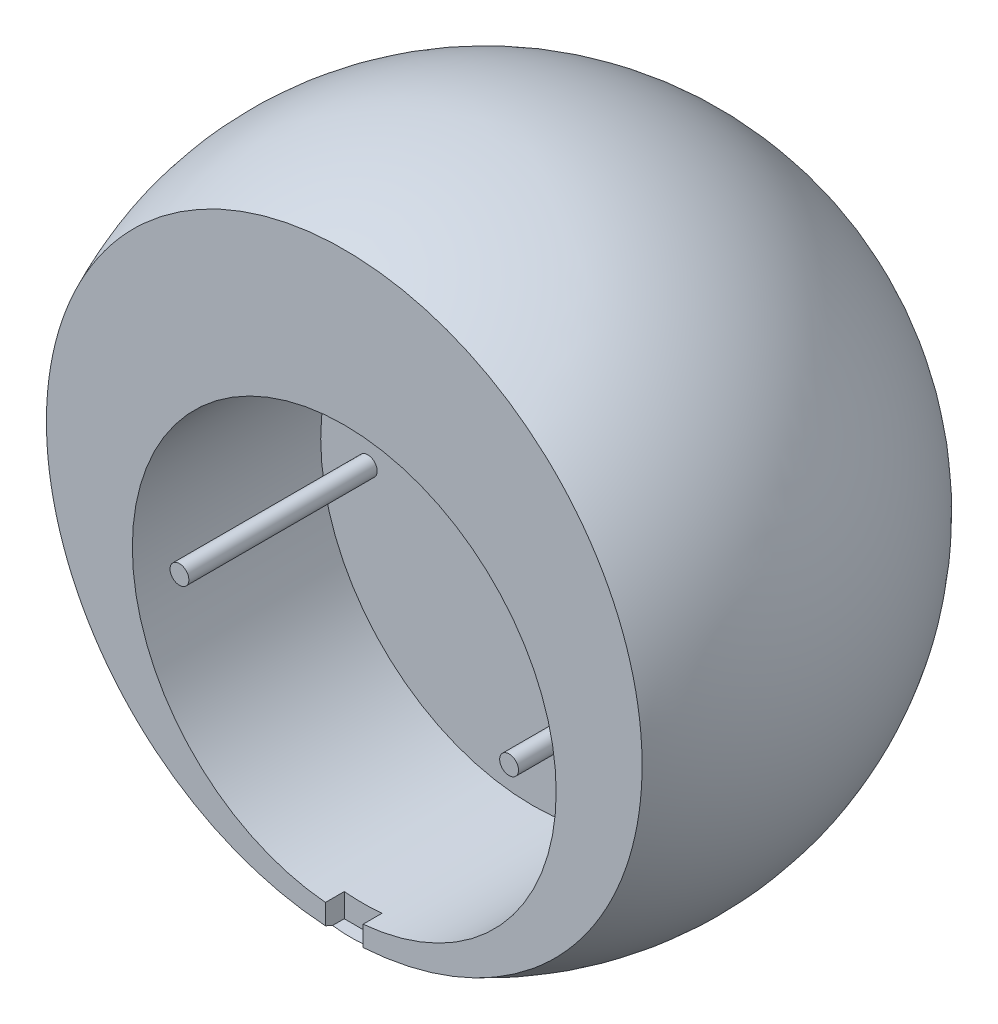
ISO-10303-21;
HEADER;
FILE_DESCRIPTION(('STEP AP214'),'2;1');
FILE_NAME('part.step','',(''),(''),'','','');
FILE_SCHEMA(('AUTOMOTIVE_DESIGN { 1 0 10303 214 1 1 1 1 }'));
ENDSEC;
DATA;
#1=APPLICATION_CONTEXT('core data for automotive mechanical design processes');
#2=APPLICATION_PROTOCOL_DEFINITION('international standard','automotive_design',2000,#1);
#3=PRODUCT_CONTEXT('',#1,'mechanical');
#4=PRODUCT('Part','Part','',(#3));
#5=PRODUCT_RELATED_PRODUCT_CATEGORY('part','',(#4));
#6=PRODUCT_DEFINITION_FORMATION('','',#4);
#7=PRODUCT_DEFINITION_CONTEXT('part definition',#1,'design');
#8=PRODUCT_DEFINITION('design','',#6,#7);
#9=PRODUCT_DEFINITION_SHAPE('','',#8);
#10=(LENGTH_UNIT() NAMED_UNIT(*) SI_UNIT(.MILLI.,.METRE.));
#11=(NAMED_UNIT(*) PLANE_ANGLE_UNIT() SI_UNIT($,.RADIAN.));
#12=(NAMED_UNIT(*) SI_UNIT($,.STERADIAN.) SOLID_ANGLE_UNIT());
#13=UNCERTAINTY_MEASURE_WITH_UNIT(LENGTH_MEASURE(1.E-05),#10,'distance_accuracy_value','');
#14=(GEOMETRIC_REPRESENTATION_CONTEXT(3) GLOBAL_UNCERTAINTY_ASSIGNED_CONTEXT((#13)) GLOBAL_UNIT_ASSIGNED_CONTEXT((#10,
#11,#12)) REPRESENTATION_CONTEXT('',''));
#15=CARTESIAN_POINT('',(0.,0.,0.));
#16=DIRECTION('',(0.,0.,1.));
#17=DIRECTION('',(1.,0.,0.));
#18=AXIS2_PLACEMENT_3D('',#15,#16,#17);
#19=CARTESIAN_POINT('',(35.,-7.,-5.));
#20=DIRECTION('',(0.,0.,1.));
#21=DIRECTION('',(1.,0.,0.));
#22=AXIS2_PLACEMENT_3D('',#19,#20,#21);
#23=PLANE('',#22);
#24=CARTESIAN_POINT('',(35.,-7.,-5.));
#25=DIRECTION('',(0.,0.,1.));
#26=DIRECTION('',(1.,0.,0.));
#27=AXIS2_PLACEMENT_3D('',#24,#25,#26);
#28=CIRCLE('',#27,22.5);
#29=CARTESIAN_POINT('',(57.5,-7.,-5.));
#30=VERTEX_POINT('',#29);
#31=EDGE_CURVE('E125',#30,#30,#28,.T.);
#32=ORIENTED_EDGE('',*,*,#31,.T.);
#33=EDGE_LOOP('',(#32));
#34=FACE_BOUND('',#33,.T.);
#35=CARTESIAN_POINT('',(17.5,-7.,-5.));
#36=DIRECTION('',(0.,0.,1.));
#37=DIRECTION('',(1.,0.,0.));
#38=AXIS2_PLACEMENT_3D('',#35,#36,#37);
#39=CIRCLE('',#38,0.999999999999998);
#40=CARTESIAN_POINT('',(18.5,-7.,-5.));
#41=VERTEX_POINT('',#40);
#42=EDGE_CURVE('E122',#41,#41,#39,.T.);
#43=ORIENTED_EDGE('',*,*,#42,.F.);
#44=EDGE_LOOP('',(#43));
#45=FACE_BOUND('',#44,.T.);
#46=CARTESIAN_POINT('',(52.5,-7.,-5.));
#47=DIRECTION('',(0.,0.,1.));
#48=DIRECTION('',(1.,0.,0.));
#49=AXIS2_PLACEMENT_3D('',#46,#47,#48);
#50=CIRCLE('',#49,0.999999999999998);
#51=CARTESIAN_POINT('',(53.5,-7.,-5.));
#52=VERTEX_POINT('',#51);
#53=EDGE_CURVE('E119',#52,#52,#50,.T.);
#54=ORIENTED_EDGE('',*,*,#53,.F.);
#55=EDGE_LOOP('',(#54));
#56=FACE_BOUND('',#55,.T.);
#57=ADVANCED_FACE('F35',(#34,#45,#56),#23,.T.);
#58=CARTESIAN_POINT('',(35.,-7.,15.));
#59=DIRECTION('',(0.,0.,-1.));
#60=DIRECTION('',(-1.,0.,0.));
#61=AXIS2_PLACEMENT_3D('',#58,#59,#60);
#62=CYLINDRICAL_SURFACE('',#61,22.5);
#63=DIRECTION('',(0.,0.,1.));
#64=VECTOR('',#63,1.);
#65=CARTESIAN_POINT('',(33.,-29.410934831015,13.));
#66=LINE('',#65,#64);
#67=CARTESIAN_POINT('',(33.,-29.410934831015,13.));
#68=VERTEX_POINT('',#67);
#69=CARTESIAN_POINT('',(33.,-29.410934831015,15.));
#70=VERTEX_POINT('',#69);
#71=EDGE_CURVE('E103',#68,#70,#66,.T.);
#72=ORIENTED_EDGE('',*,*,#71,.F.);
#73=CARTESIAN_POINT('',(35.,-7.,13.));
#74=DIRECTION('',(0.,0.,-1.));
#75=DIRECTION('',(-1.,0.,0.));
#76=AXIS2_PLACEMENT_3D('',#73,#74,#75);
#77=CIRCLE('',#76,22.5);
#78=CARTESIAN_POINT('',(37.,-29.410934831015,13.));
#79=VERTEX_POINT('',#78);
#80=EDGE_CURVE('E11',#79,#68,#77,.T.);
#81=ORIENTED_EDGE('',*,*,#80,.F.);
#82=DIRECTION('',(0.,0.,1.));
#83=VECTOR('',#82,1.);
#84=CARTESIAN_POINT('',(37.,-29.410934831015,13.));
#85=LINE('',#84,#83);
#86=CARTESIAN_POINT('',(37.,-29.410934831015,15.));
#87=VERTEX_POINT('',#86);
#88=EDGE_CURVE('E106',#79,#87,#85,.T.);
#89=ORIENTED_EDGE('',*,*,#88,.T.);
#90=CARTESIAN_POINT('',(35.,-7.,15.));
#91=DIRECTION('',(0.,0.,1.));
#92=DIRECTION('',(1.,0.,0.));
#93=AXIS2_PLACEMENT_3D('',#90,#91,#92);
#94=CIRCLE('',#93,22.5);
#95=EDGE_CURVE('E116',#87,#70,#94,.T.);
#96=ORIENTED_EDGE('',*,*,#95,.T.);
#97=EDGE_LOOP('',(#72,#81,#89,#96));
#98=FACE_BOUND('',#97,.T.);
#99=ORIENTED_EDGE('',*,*,#31,.F.);
#100=EDGE_LOOP('',(#99));
#101=FACE_BOUND('',#100,.T.);
#102=ADVANCED_FACE('F143',(#98,#101),#62,.F.);
#103=CARTESIAN_POINT('',(17.5,-7.,15.));
#104=DIRECTION('',(0.,0.,-1.));
#105=DIRECTION('',(-1.,0.,0.));
#106=AXIS2_PLACEMENT_3D('',#103,#104,#105);
#107=CYLINDRICAL_SURFACE('',#106,0.999999999999998);
#108=CARTESIAN_POINT('',(17.5,-7.,15.));
#109=DIRECTION('',(0.,0.,1.));
#110=DIRECTION('',(1.,0.,0.));
#111=AXIS2_PLACEMENT_3D('',#108,#109,#110);
#112=CIRCLE('',#111,0.999999999999998);
#113=CARTESIAN_POINT('',(18.5,-7.,15.));
#114=VERTEX_POINT('',#113);
#115=EDGE_CURVE('E113',#114,#114,#112,.T.);
#116=ORIENTED_EDGE('',*,*,#115,.F.);
#117=EDGE_LOOP('',(#116));
#118=FACE_BOUND('',#117,.T.);
#119=ORIENTED_EDGE('',*,*,#42,.T.);
#120=EDGE_LOOP('',(#119));
#121=FACE_BOUND('',#120,.T.);
#122=ADVANCED_FACE('F146',(#118,#121),#107,.T.);
#123=CARTESIAN_POINT('',(52.5,-7.,15.));
#124=DIRECTION('',(0.,0.,-1.));
#125=DIRECTION('',(-1.,0.,0.));
#126=AXIS2_PLACEMENT_3D('',#123,#124,#125);
#127=CYLINDRICAL_SURFACE('',#126,0.999999999999998);
#128=CARTESIAN_POINT('',(52.5,-7.,15.));
#129=DIRECTION('',(0.,0.,1.));
#130=DIRECTION('',(1.,0.,0.));
#131=AXIS2_PLACEMENT_3D('',#128,#129,#130);
#132=CIRCLE('',#131,0.999999999999998);
#133=CARTESIAN_POINT('',(53.5,-7.,15.));
#134=VERTEX_POINT('',#133);
#135=EDGE_CURVE('E110',#134,#134,#132,.T.);
#136=ORIENTED_EDGE('',*,*,#135,.F.);
#137=EDGE_LOOP('',(#136));
#138=FACE_BOUND('',#137,.T.);
#139=ORIENTED_EDGE('',*,*,#53,.T.);
#140=EDGE_LOOP('',(#139));
#141=FACE_BOUND('',#140,.T.);
#142=ADVANCED_FACE('F156',(#138,#141),#127,.T.);
#143=CARTESIAN_POINT('',(0.,0.,15.));
#144=DIRECTION('',(0.,0.,1.));
#145=DIRECTION('',(1.,0.,0.));
#146=AXIS2_PLACEMENT_3D('',#143,#144,#145);
#147=PLANE('',#146);
#148=DIRECTION('',(0.,-1.,0.));
#149=VECTOR('',#148,1.);
#150=CARTESIAN_POINT('',(33.,-31.910934831015,15.));
#151=LINE('',#150,#149);
#152=CARTESIAN_POINT('',(33.,-31.559467676119,15.));
#153=VERTEX_POINT('',#152);
#154=EDGE_CURVE('E98',#70,#153,#151,.T.);
#155=ORIENTED_EDGE('',*,*,#154,.F.);
#156=ORIENTED_EDGE('',*,*,#95,.F.);
#157=DIRECTION('',(0.,1.,0.));
#158=VECTOR('',#157,1.);
#159=CARTESIAN_POINT('',(37.,-29.410934831015,15.));
#160=LINE('',#159,#158);
#161=CARTESIAN_POINT('',(37.,-31.559467676119,15.));
#162=VERTEX_POINT('',#161);
#163=EDGE_CURVE('E96',#162,#87,#160,.T.);
#164=ORIENTED_EDGE('',*,*,#163,.F.);
#165=CARTESIAN_POINT('',(35.,0.,15.));
#166=DIRECTION('',(0.,0.,1.));
#167=DIRECTION('',(1.,0.,0.));
#168=AXIS2_PLACEMENT_3D('',#165,#166,#167);
#169=CIRCLE('',#168,31.6227766016838);
#170=EDGE_CURVE('E105',#162,#153,#169,.T.);
#171=ORIENTED_EDGE('',*,*,#170,.T.);
#172=EDGE_LOOP('',(#155,#156,#164,#171));
#173=FACE_BOUND('',#172,.T.);
#174=ADVANCED_FACE('F138',(#173),#147,.T.);
#175=ORIENTED_EDGE('',*,*,#135,.T.);
#176=EDGE_LOOP('',(#175));
#177=FACE_BOUND('',#176,.T.);
#178=ADVANCED_FACE('F164',(#177),#147,.T.);
#179=ORIENTED_EDGE('',*,*,#115,.T.);
#180=EDGE_LOOP('',(#179));
#181=FACE_BOUND('',#180,.T.);
#182=ADVANCED_FACE('F166',(#181),#147,.T.);
#183=CARTESIAN_POINT('',(35.,0.,0.));
#184=DIRECTION('',(-1.,0.,0.));
#185=DIRECTION('',(0.,1.,0.));
#186=AXIS2_PLACEMENT_3D('',#183,#184,#185);
#187=SPHERICAL_SURFACE('',#186,35.);
#188=CARTESIAN_POINT('',(35.,-31.910934831015,0.));
#189=DIRECTION('',(0.,-1.,0.));
#190=DIRECTION('',(0.,0.,-1.));
#191=AXIS2_PLACEMENT_3D('',#188,#189,#190);
#192=CIRCLE('',#191,14.3767951300252);
#193=CARTESIAN_POINT('',(37.,-31.910934831015,14.2370024306634));
#194=VERTEX_POINT('',#193);
#195=CARTESIAN_POINT('',(33.,-31.910934831015,14.2370024306634));
#196=VERTEX_POINT('',#195);
#197=EDGE_CURVE('E55',#194,#196,#192,.T.);
#198=ORIENTED_EDGE('',*,*,#197,.T.);
#199=CARTESIAN_POINT('',(33.,0.,0.));
#200=DIRECTION('',(-1.,0.,0.));
#201=DIRECTION('',(0.,0.,1.));
#202=AXIS2_PLACEMENT_3D('',#199,#200,#201);
#203=CIRCLE('',#202,34.9428104193123);
#204=EDGE_CURVE('E43',#196,#153,#203,.T.);
#205=ORIENTED_EDGE('',*,*,#204,.T.);
#206=ORIENTED_EDGE('',*,*,#170,.F.);
#207=CARTESIAN_POINT('',(37.,0.,0.));
#208=DIRECTION('',(1.,0.,0.));
#209=DIRECTION('',(0.,0.,-1.));
#210=AXIS2_PLACEMENT_3D('',#207,#208,#209);
#211=CIRCLE('',#210,34.9428104193123);
#212=EDGE_CURVE('E131',#162,#194,#211,.T.);
#213=ORIENTED_EDGE('',*,*,#212,.T.);
#214=EDGE_LOOP('',(#198,#205,#206,#213));
#215=FACE_BOUND('',#214,.T.);
#216=ADVANCED_FACE('F37',(#215),#187,.T.);
#217=CARTESIAN_POINT('',(33.,-31.910934831015,13.));
#218=DIRECTION('',(-1.,0.,0.));
#219=DIRECTION('',(0.,0.,1.));
#220=AXIS2_PLACEMENT_3D('',#217,#218,#219);
#221=PLANE('',#220);
#222=DIRECTION('',(0.,0.,1.));
#223=VECTOR('',#222,1.);
#224=CARTESIAN_POINT('',(33.,-31.910934831015,13.));
#225=LINE('',#224,#223);
#226=CARTESIAN_POINT('',(33.,-31.910934831015,13.));
#227=VERTEX_POINT('',#226);
#228=EDGE_CURVE('E50',#227,#196,#225,.T.);
#229=ORIENTED_EDGE('',*,*,#228,.F.);
#230=DIRECTION('',(0.,-1.,0.));
#231=VECTOR('',#230,1.);
#232=CARTESIAN_POINT('',(33.,-31.910934831015,13.));
#233=LINE('',#232,#231);
#234=EDGE_CURVE('E81',#68,#227,#233,.T.);
#235=ORIENTED_EDGE('',*,*,#234,.F.);
#236=ORIENTED_EDGE('',*,*,#71,.T.);
#237=ORIENTED_EDGE('',*,*,#154,.T.);
#238=ORIENTED_EDGE('',*,*,#204,.F.);
#239=EDGE_LOOP('',(#229,#235,#236,#237,#238));
#240=FACE_BOUND('',#239,.T.);
#241=ADVANCED_FACE('F79',(#240),#221,.F.);
#242=CARTESIAN_POINT('',(37.,-29.410934831015,13.));
#243=DIRECTION('',(1.,0.,0.));
#244=DIRECTION('',(0.,0.,-1.));
#245=AXIS2_PLACEMENT_3D('',#242,#243,#244);
#246=PLANE('',#245);
#247=ORIENTED_EDGE('',*,*,#163,.T.);
#248=ORIENTED_EDGE('',*,*,#88,.F.);
#249=DIRECTION('',(0.,1.,0.));
#250=VECTOR('',#249,1.);
#251=CARTESIAN_POINT('',(37.,-29.410934831015,13.));
#252=LINE('',#251,#250);
#253=CARTESIAN_POINT('',(37.,-31.910934831015,13.));
#254=VERTEX_POINT('',#253);
#255=EDGE_CURVE('E85',#254,#79,#252,.T.);
#256=ORIENTED_EDGE('',*,*,#255,.F.);
#257=DIRECTION('',(0.,0.,1.));
#258=VECTOR('',#257,1.);
#259=CARTESIAN_POINT('',(37.,-31.910934831015,13.));
#260=LINE('',#259,#258);
#261=EDGE_CURVE('E84',#254,#194,#260,.T.);
#262=ORIENTED_EDGE('',*,*,#261,.T.);
#263=ORIENTED_EDGE('',*,*,#212,.F.);
#264=EDGE_LOOP('',(#247,#248,#256,#262,#263));
#265=FACE_BOUND('',#264,.T.);
#266=ADVANCED_FACE('F141',(#265),#246,.F.);
#267=CARTESIAN_POINT('',(37.,-31.910934831015,13.));
#268=DIRECTION('',(0.,-1.,0.));
#269=DIRECTION('',(0.,0.,-1.));
#270=AXIS2_PLACEMENT_3D('',#267,#268,#269);
#271=PLANE('',#270);
#272=ORIENTED_EDGE('',*,*,#261,.F.);
#273=DIRECTION('',(1.,0.,0.));
#274=VECTOR('',#273,1.);
#275=CARTESIAN_POINT('',(37.,-31.910934831015,13.));
#276=LINE('',#275,#274);
#277=EDGE_CURVE('E88',#227,#254,#276,.T.);
#278=ORIENTED_EDGE('',*,*,#277,.F.);
#279=ORIENTED_EDGE('',*,*,#228,.T.);
#280=ORIENTED_EDGE('',*,*,#197,.F.);
#281=EDGE_LOOP('',(#272,#278,#279,#280));
#282=FACE_BOUND('',#281,.T.);
#283=ADVANCED_FACE('F89',(#282),#271,.F.);
#284=CARTESIAN_POINT('',(0.,0.,13.));
#285=DIRECTION('',(0.,0.,-1.));
#286=DIRECTION('',(-1.,0.,0.));
#287=AXIS2_PLACEMENT_3D('',#284,#285,#286);
#288=PLANE('',#287);
#289=ORIENTED_EDGE('',*,*,#80,.T.);
#290=ORIENTED_EDGE('',*,*,#234,.T.);
#291=ORIENTED_EDGE('',*,*,#277,.T.);
#292=ORIENTED_EDGE('',*,*,#255,.T.);
#293=EDGE_LOOP('',(#289,#290,#291,#292));
#294=FACE_BOUND('',#293,.T.);
#295=ADVANCED_FACE('F94',(#294),#288,.F.);
#296=CLOSED_SHELL('',(#57,#102,#122,#142,#174,#178,#182,#216,#241,#266,#283,#295));
#297=MANIFOLD_SOLID_BREP('B2',#296);
#298=ADVANCED_BREP_SHAPE_REPRESENTATION('',(#18,#297),#14);
#299=SHAPE_DEFINITION_REPRESENTATION(#9,#298);
ENDSEC;
END-ISO-10303-21;
